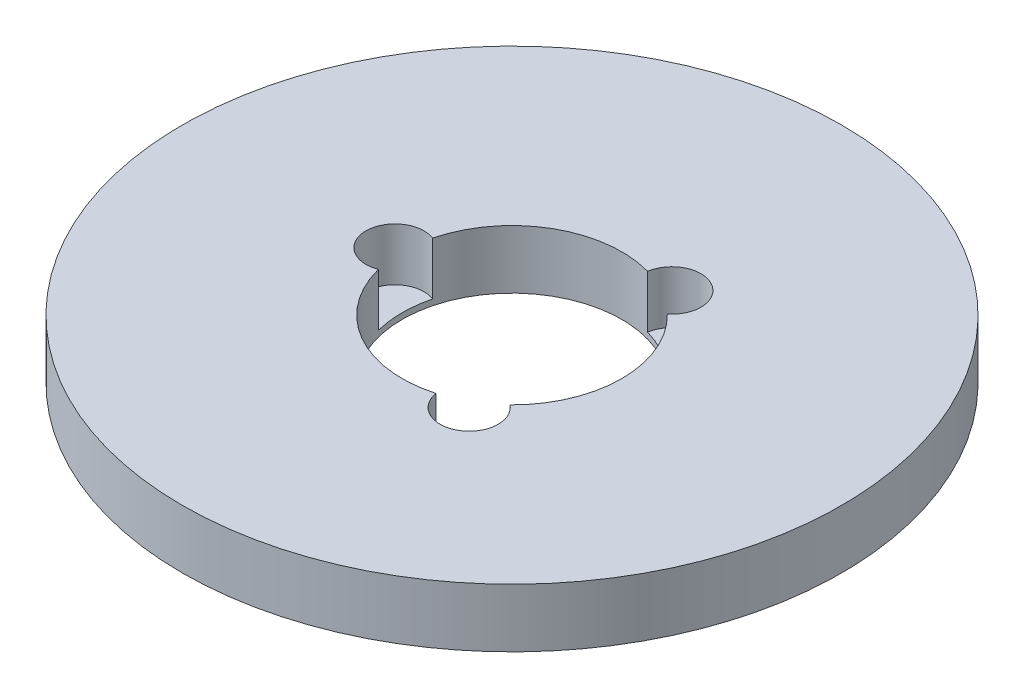
ISO-10303-21;
HEADER;
FILE_DESCRIPTION(('STEP AP214'),'2;1');
FILE_NAME('part.step','',(''),(''),'','','');
FILE_SCHEMA(('AUTOMOTIVE_DESIGN { 1 0 10303 214 1 1 1 1 }'));
ENDSEC;
DATA;
#1=APPLICATION_CONTEXT('core data for automotive mechanical design processes');
#2=APPLICATION_PROTOCOL_DEFINITION('international standard','automotive_design',2000,#1);
#3=PRODUCT_CONTEXT('',#1,'mechanical');
#4=PRODUCT('Part','Part','',(#3));
#5=PRODUCT_RELATED_PRODUCT_CATEGORY('part','',(#4));
#6=PRODUCT_DEFINITION_FORMATION('','',#4);
#7=PRODUCT_DEFINITION_CONTEXT('part definition',#1,'design');
#8=PRODUCT_DEFINITION('design','',#6,#7);
#9=PRODUCT_DEFINITION_SHAPE('','',#8);
#10=(LENGTH_UNIT() NAMED_UNIT(*) SI_UNIT(.MILLI.,.METRE.));
#11=(NAMED_UNIT(*) PLANE_ANGLE_UNIT() SI_UNIT($,.RADIAN.));
#12=(NAMED_UNIT(*) SI_UNIT($,.STERADIAN.) SOLID_ANGLE_UNIT());
#13=UNCERTAINTY_MEASURE_WITH_UNIT(LENGTH_MEASURE(1.E-05),#10,'distance_accuracy_value','');
#14=(GEOMETRIC_REPRESENTATION_CONTEXT(3) GLOBAL_UNCERTAINTY_ASSIGNED_CONTEXT((#13)) GLOBAL_UNIT_ASSIGNED_CONTEXT((#10,
#11,#12)) REPRESENTATION_CONTEXT('',''));
#15=CARTESIAN_POINT('',(0.,0.,0.));
#16=DIRECTION('',(0.,0.,1.));
#17=DIRECTION('',(1.,0.,0.));
#18=AXIS2_PLACEMENT_3D('',#15,#16,#17);
#19=CARTESIAN_POINT('',(0.,16.,0.));
#20=DIRECTION('',(0.,-1.,0.));
#21=DIRECTION('',(0.,0.,-1.));
#22=AXIS2_PLACEMENT_3D('',#19,#20,#21);
#23=CYLINDRICAL_SURFACE('',#22,90.);
#24=CARTESIAN_POINT('',(0.,16.,0.));
#25=DIRECTION('',(0.,1.,0.));
#26=DIRECTION('',(0.,0.,1.));
#27=AXIS2_PLACEMENT_3D('',#24,#25,#26);
#28=CIRCLE('',#27,90.);
#29=CARTESIAN_POINT('',(0.,16.,90.));
#30=VERTEX_POINT('',#29);
#31=EDGE_CURVE('E126',#30,#30,#28,.T.);
#32=ORIENTED_EDGE('',*,*,#31,.F.);
#33=EDGE_LOOP('',(#32));
#34=FACE_BOUND('',#33,.T.);
#35=CARTESIAN_POINT('',(0.,0.,0.));
#36=DIRECTION('',(0.,1.,0.));
#37=DIRECTION('',(0.,0.,1.));
#38=AXIS2_PLACEMENT_3D('',#35,#36,#37);
#39=CIRCLE('',#38,90.);
#40=CARTESIAN_POINT('',(0.,0.,90.));
#41=VERTEX_POINT('',#40);
#42=EDGE_CURVE('E124',#41,#41,#39,.T.);
#43=ORIENTED_EDGE('',*,*,#42,.T.);
#44=EDGE_LOOP('',(#43));
#45=FACE_BOUND('',#44,.T.);
#46=ADVANCED_FACE('F39',(#34,#45),#23,.T.);
#47=CARTESIAN_POINT('',(0.,16.,0.));
#48=DIRECTION('',(0.,1.,0.));
#49=DIRECTION('',(0.,0.,1.));
#50=AXIS2_PLACEMENT_3D('',#47,#48,#49);
#51=PLANE('',#50);
#52=CARTESIAN_POINT('',(15.9780478292727,16.,27.6747906460656));
#53=DIRECTION('',(0.,1.,0.));
#54=DIRECTION('',(0.866025403784436,0.,-0.500000000000004));
#55=AXIS2_PLACEMENT_3D('',#52,#53,#54);
#56=CIRCLE('',#55,7.94025557667615);
#57=CARTESIAN_POINT('',(8.12941481518251,16.,28.8775451651052));
#58=VERTEX_POINT('',#57);
#59=CARTESIAN_POINT('',(20.9439803043225,16.,21.479052330402));
#60=VERTEX_POINT('',#59);
#61=EDGE_CURVE('E147',#58,#60,#56,.T.);
#62=ORIENTED_EDGE('',*,*,#61,.F.);
#63=CARTESIAN_POINT('',(0.,16.,0.));
#64=DIRECTION('',(0.,1.,0.));
#65=DIRECTION('',(0.,0.,1.));
#66=AXIS2_PLACEMENT_3D('',#63,#64,#65);
#67=CIRCLE('',#66,30.);
#68=CARTESIAN_POINT('',(-29.0733951195048,16.,7.39849283470311));
#69=VERTEX_POINT('',#68);
#70=EDGE_CURVE('E118',#69,#58,#67,.T.);
#71=ORIENTED_EDGE('',*,*,#70,.F.);
#72=CARTESIAN_POINT('',(-31.9560956585451,16.,0.));
#73=DIRECTION('',(0.,1.,0.));
#74=DIRECTION('',(0.,0.,1.));
#75=AXIS2_PLACEMENT_3D('',#72,#73,#74);
#76=CIRCLE('',#75,7.94025557667615);
#77=CARTESIAN_POINT('',(-29.0733951195048,16.,-7.39849283470311));
#78=VERTEX_POINT('',#77);
#79=EDGE_CURVE('E113',#78,#69,#76,.T.);
#80=ORIENTED_EDGE('',*,*,#79,.F.);
#81=CARTESIAN_POINT('',(8.1294148151821,16.,-28.8775451651053));
#82=VERTEX_POINT('',#81);
#83=EDGE_CURVE('E106',#82,#78,#67,.T.);
#84=ORIENTED_EDGE('',*,*,#83,.F.);
#85=CARTESIAN_POINT('',(15.9780478292723,16.,-27.6747906460658));
#86=DIRECTION('',(0.,1.,0.));
#87=DIRECTION('',(-0.866025403784443,0.,-0.499999999999992));
#88=AXIS2_PLACEMENT_3D('',#85,#86,#87);
#89=CIRCLE('',#88,7.94025557667615);
#90=CARTESIAN_POINT('',(20.9439803043222,16.,-21.4790523304023));
#91=VERTEX_POINT('',#90);
#92=EDGE_CURVE('E90',#91,#82,#89,.T.);
#93=ORIENTED_EDGE('',*,*,#92,.F.);
#94=EDGE_CURVE('E116',#60,#91,#67,.T.);
#95=ORIENTED_EDGE('',*,*,#94,.F.);
#96=EDGE_LOOP('',(#62,#71,#80,#84,#93,#95));
#97=FACE_BOUND('',#96,.T.);
#98=ORIENTED_EDGE('',*,*,#31,.T.);
#99=EDGE_LOOP('',(#98));
#100=FACE_BOUND('',#99,.T.);
#101=ADVANCED_FACE('F115',(#97,#100),#51,.T.);
#102=CARTESIAN_POINT('',(0.,0.,0.));
#103=DIRECTION('',(0.,1.,0.));
#104=DIRECTION('',(0.,0.,1.));
#105=AXIS2_PLACEMENT_3D('',#102,#103,#104);
#106=PLANE('',#105);
#107=CARTESIAN_POINT('',(0.,0.,0.));
#108=DIRECTION('',(0.,1.,0.));
#109=DIRECTION('',(0.,0.,1.));
#110=AXIS2_PLACEMENT_3D('',#107,#108,#109);
#111=CIRCLE('',#110,30.);
#112=CARTESIAN_POINT('',(0.,0.,30.));
#113=VERTEX_POINT('',#112);
#114=EDGE_CURVE('E120',#113,#113,#111,.T.);
#115=ORIENTED_EDGE('',*,*,#114,.T.);
#116=EDGE_LOOP('',(#115));
#117=FACE_BOUND('',#116,.T.);
#118=ORIENTED_EDGE('',*,*,#42,.F.);
#119=EDGE_LOOP('',(#118));
#120=FACE_BOUND('',#119,.T.);
#121=ADVANCED_FACE('F164',(#117,#120),#106,.F.);
#122=CARTESIAN_POINT('',(0.,16.,0.));
#123=DIRECTION('',(0.,-1.,0.));
#124=DIRECTION('',(0.,0.,-1.));
#125=AXIS2_PLACEMENT_3D('',#122,#123,#124);
#126=CYLINDRICAL_SURFACE('',#125,30.);
#127=DIRECTION('',(0.,1.,0.));
#128=VECTOR('',#127,1.);
#129=CARTESIAN_POINT('',(8.12941481518251,8.80008913080325,28.8775451651052));
#130=LINE('',#129,#128);
#131=CARTESIAN_POINT('',(8.12941481518251,1.60017826160649,28.8775451651052));
#132=VERTEX_POINT('',#131);
#133=EDGE_CURVE('E11',#132,#58,#130,.T.);
#134=ORIENTED_EDGE('',*,*,#133,.F.);
#135=CARTESIAN_POINT('',(0.,1.60017826160649,0.));
#136=DIRECTION('',(0.,1.,0.));
#137=DIRECTION('',(0.,0.,1.));
#138=AXIS2_PLACEMENT_3D('',#135,#136,#137);
#139=CIRCLE('',#138,30.);
#140=CARTESIAN_POINT('',(20.9439803043225,1.60017826160649,21.479052330402));
#141=VERTEX_POINT('',#140);
#142=EDGE_CURVE('E144',#132,#141,#139,.T.);
#143=ORIENTED_EDGE('',*,*,#142,.T.);
#144=DIRECTION('',(0.,1.,0.));
#145=VECTOR('',#144,1.);
#146=CARTESIAN_POINT('',(20.9439803043225,8.80008913080325,21.479052330402));
#147=LINE('',#146,#145);
#148=EDGE_CURVE('E46',#60,#141,#147,.F.);
#149=ORIENTED_EDGE('',*,*,#148,.F.);
#150=ORIENTED_EDGE('',*,*,#94,.T.);
#151=DIRECTION('',(0.,1.,0.));
#152=VECTOR('',#151,1.);
#153=CARTESIAN_POINT('',(20.9439803043222,8.80008913080325,-21.4790523304023));
#154=LINE('',#153,#152);
#155=CARTESIAN_POINT('',(20.9439803043222,1.60017826160649,-21.4790523304023));
#156=VERTEX_POINT('',#155);
#157=EDGE_CURVE('E92',#156,#91,#154,.T.);
#158=ORIENTED_EDGE('',*,*,#157,.F.);
#159=CARTESIAN_POINT('',(0.,1.60017826160649,0.));
#160=DIRECTION('',(0.,1.,0.));
#161=DIRECTION('',(0.,0.,1.));
#162=AXIS2_PLACEMENT_3D('',#159,#160,#161);
#163=CIRCLE('',#162,30.);
#164=CARTESIAN_POINT('',(8.1294148151821,1.60017826160649,-28.8775451651053));
#165=VERTEX_POINT('',#164);
#166=EDGE_CURVE('E107',#156,#165,#163,.T.);
#167=ORIENTED_EDGE('',*,*,#166,.T.);
#168=DIRECTION('',(0.,1.,0.));
#169=VECTOR('',#168,1.);
#170=CARTESIAN_POINT('',(8.1294148151821,8.80008913080325,-28.8775451651053));
#171=LINE('',#170,#169);
#172=EDGE_CURVE('E95',#82,#165,#171,.F.);
#173=ORIENTED_EDGE('',*,*,#172,.F.);
#174=ORIENTED_EDGE('',*,*,#83,.T.);
#175=DIRECTION('',(0.,1.,0.));
#176=VECTOR('',#175,1.);
#177=CARTESIAN_POINT('',(-29.0733951195048,8.80008913080325,-7.39849283470311));
#178=LINE('',#177,#176);
#179=CARTESIAN_POINT('',(-29.0733951195048,1.60017826160649,-7.39849283470311));
#180=VERTEX_POINT('',#179);
#181=EDGE_CURVE('E143',#180,#78,#178,.T.);
#182=ORIENTED_EDGE('',*,*,#181,.F.);
#183=CARTESIAN_POINT('',(0.,1.60017826160649,0.));
#184=DIRECTION('',(0.,1.,0.));
#185=DIRECTION('',(0.,0.,1.));
#186=AXIS2_PLACEMENT_3D('',#183,#184,#185);
#187=CIRCLE('',#186,30.);
#188=CARTESIAN_POINT('',(-29.0733951195048,1.60017826160649,7.39849283470311));
#189=VERTEX_POINT('',#188);
#190=EDGE_CURVE('E132',#180,#189,#187,.T.);
#191=ORIENTED_EDGE('',*,*,#190,.T.);
#192=DIRECTION('',(0.,1.,0.));
#193=VECTOR('',#192,1.);
#194=CARTESIAN_POINT('',(-29.0733951195048,8.80008913080325,7.39849283470311));
#195=LINE('',#194,#193);
#196=EDGE_CURVE('E137',#69,#189,#195,.F.);
#197=ORIENTED_EDGE('',*,*,#196,.F.);
#198=ORIENTED_EDGE('',*,*,#70,.T.);
#199=EDGE_LOOP('',(#134,#143,#149,#150,#158,#167,#173,#174,#182,#191,#197,#198));
#200=FACE_BOUND('',#199,.T.);
#201=ORIENTED_EDGE('',*,*,#114,.F.);
#202=EDGE_LOOP('',(#201));
#203=FACE_BOUND('',#202,.T.);
#204=ADVANCED_FACE('F103',(#200,#203),#126,.F.);
#205=CARTESIAN_POINT('',(-31.9560956585451,1.60017826160649,0.));
#206=DIRECTION('',(0.,1.,0.));
#207=DIRECTION('',(0.,0.,1.));
#208=AXIS2_PLACEMENT_3D('',#205,#206,#207);
#209=CYLINDRICAL_SURFACE('',#208,7.94025557667615);
#210=ORIENTED_EDGE('',*,*,#181,.T.);
#211=ORIENTED_EDGE('',*,*,#79,.T.);
#212=ORIENTED_EDGE('',*,*,#196,.T.);
#213=CARTESIAN_POINT('',(-31.9560956585451,1.60017826160649,0.));
#214=DIRECTION('',(0.,1.,0.));
#215=DIRECTION('',(0.,0.,1.));
#216=AXIS2_PLACEMENT_3D('',#213,#214,#215);
#217=CIRCLE('',#216,7.94025557667615);
#218=EDGE_CURVE('E121',#180,#189,#217,.T.);
#219=ORIENTED_EDGE('',*,*,#218,.F.);
#220=EDGE_LOOP('',(#210,#211,#212,#219));
#221=FACE_BOUND('',#220,.T.);
#222=ADVANCED_FACE('F174',(#221),#209,.F.);
#223=CARTESIAN_POINT('',(-31.9560956585451,1.60017826160649,0.));
#224=DIRECTION('',(0.,1.,0.));
#225=DIRECTION('',(0.,0.,1.));
#226=AXIS2_PLACEMENT_3D('',#223,#224,#225);
#227=PLANE('',#226);
#228=ORIENTED_EDGE('',*,*,#218,.T.);
#229=ORIENTED_EDGE('',*,*,#190,.F.);
#230=EDGE_LOOP('',(#228,#229));
#231=FACE_BOUND('',#230,.T.);
#232=ADVANCED_FACE('F177',(#231),#227,.T.);
#233=CARTESIAN_POINT('',(15.9780478292723,1.60017826160649,-27.6747906460658));
#234=DIRECTION('',(0.,1.,0.));
#235=DIRECTION('',(0.,0.,1.));
#236=AXIS2_PLACEMENT_3D('',#233,#234,#235);
#237=CYLINDRICAL_SURFACE('',#236,7.94025557667615);
#238=ORIENTED_EDGE('',*,*,#157,.T.);
#239=ORIENTED_EDGE('',*,*,#92,.T.);
#240=ORIENTED_EDGE('',*,*,#172,.T.);
#241=CARTESIAN_POINT('',(15.9780478292723,1.60017826160649,-27.6747906460658));
#242=DIRECTION('',(0.,1.,0.));
#243=DIRECTION('',(-0.866025403784443,0.,-0.499999999999992));
#244=AXIS2_PLACEMENT_3D('',#241,#242,#243);
#245=CIRCLE('',#244,7.94025557667615);
#246=EDGE_CURVE('E56',#156,#165,#245,.T.);
#247=ORIENTED_EDGE('',*,*,#246,.F.);
#248=EDGE_LOOP('',(#238,#239,#240,#247));
#249=FACE_BOUND('',#248,.T.);
#250=ADVANCED_FACE('F93',(#249),#237,.F.);
#251=CARTESIAN_POINT('',(15.9780478292723,1.60017826160649,-27.6747906460658));
#252=DIRECTION('',(0.,1.,0.));
#253=DIRECTION('',(-0.866025403784443,0.,-0.499999999999992));
#254=AXIS2_PLACEMENT_3D('',#251,#252,#253);
#255=PLANE('',#254);
#256=ORIENTED_EDGE('',*,*,#246,.T.);
#257=ORIENTED_EDGE('',*,*,#166,.F.);
#258=EDGE_LOOP('',(#256,#257));
#259=FACE_BOUND('',#258,.T.);
#260=ADVANCED_FACE('F160',(#259),#255,.T.);
#261=CARTESIAN_POINT('',(15.9780478292727,1.60017826160649,27.6747906460656));
#262=DIRECTION('',(0.,1.,0.));
#263=DIRECTION('',(0.,0.,1.));
#264=AXIS2_PLACEMENT_3D('',#261,#262,#263);
#265=CYLINDRICAL_SURFACE('',#264,7.94025557667615);
#266=ORIENTED_EDGE('',*,*,#133,.T.);
#267=ORIENTED_EDGE('',*,*,#61,.T.);
#268=ORIENTED_EDGE('',*,*,#148,.T.);
#269=CARTESIAN_POINT('',(15.9780478292727,1.60017826160649,27.6747906460656));
#270=DIRECTION('',(0.,1.,0.));
#271=DIRECTION('',(0.866025403784436,0.,-0.500000000000004));
#272=AXIS2_PLACEMENT_3D('',#269,#270,#271);
#273=CIRCLE('',#272,7.94025557667615);
#274=EDGE_CURVE('E55',#132,#141,#273,.T.);
#275=ORIENTED_EDGE('',*,*,#274,.F.);
#276=EDGE_LOOP('',(#266,#267,#268,#275));
#277=FACE_BOUND('',#276,.T.);
#278=ADVANCED_FACE('F149',(#277),#265,.F.);
#279=CARTESIAN_POINT('',(15.9780478292727,1.60017826160649,27.6747906460656));
#280=DIRECTION('',(0.,1.,0.));
#281=DIRECTION('',(0.866025403784436,0.,-0.500000000000004));
#282=AXIS2_PLACEMENT_3D('',#279,#280,#281);
#283=PLANE('',#282);
#284=ORIENTED_EDGE('',*,*,#274,.T.);
#285=ORIENTED_EDGE('',*,*,#142,.F.);
#286=EDGE_LOOP('',(#284,#285));
#287=FACE_BOUND('',#286,.T.);
#288=ADVANCED_FACE('F151',(#287),#283,.T.);
#289=CLOSED_SHELL('',(#46,#101,#121,#204,#222,#232,#250,#260,#278,#288));
#290=MANIFOLD_SOLID_BREP('B2',#289);
#291=ADVANCED_BREP_SHAPE_REPRESENTATION('',(#18,#290),#14);
#292=SHAPE_DEFINITION_REPRESENTATION(#9,#291);
ENDSEC;
END-ISO-10303-21;
